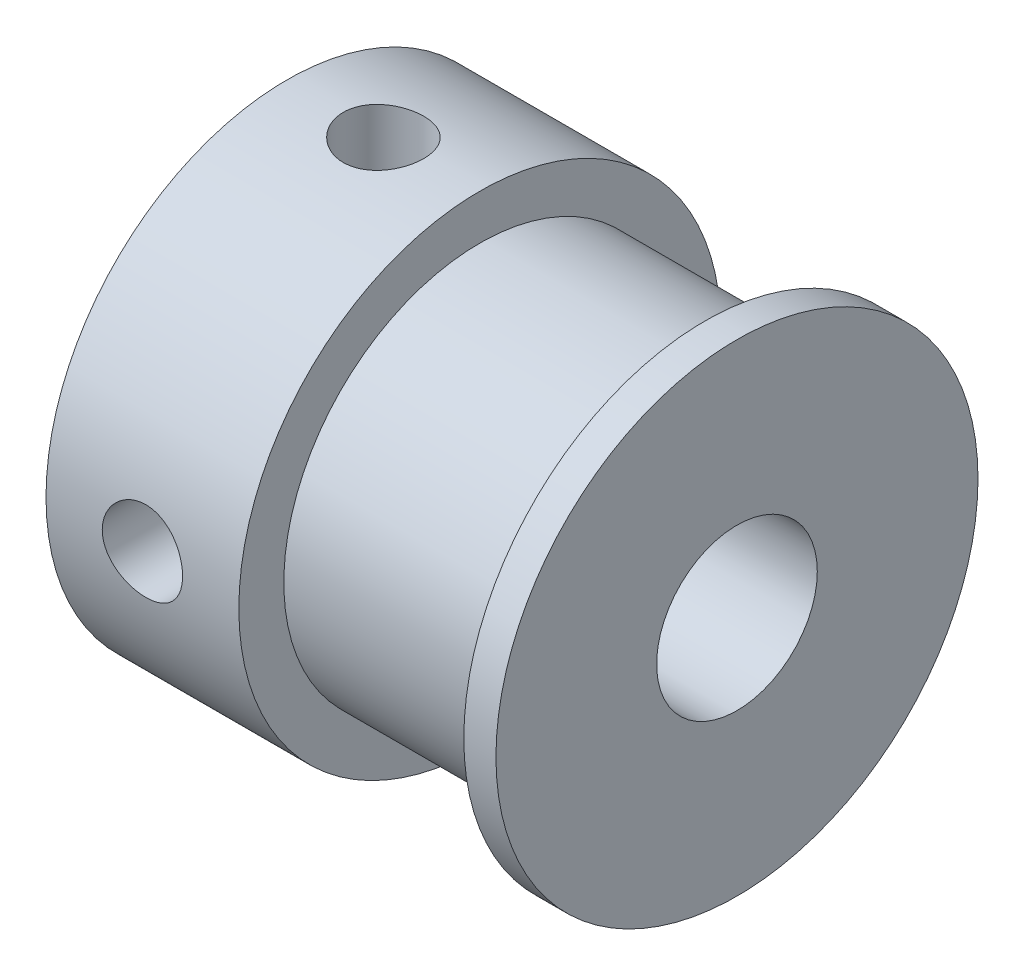
ISO-10303-21;
HEADER;
FILE_DESCRIPTION(('STEP AP214'),'2;1');
FILE_NAME('part.step','',(''),(''),'','','');
FILE_SCHEMA(('AUTOMOTIVE_DESIGN { 1 0 10303 214 1 1 1 1 }'));
ENDSEC;
DATA;
#1=APPLICATION_CONTEXT('core data for automotive mechanical design processes');
#2=APPLICATION_PROTOCOL_DEFINITION('international standard','automotive_design',2000,#1);
#3=PRODUCT_CONTEXT('',#1,'mechanical');
#4=PRODUCT('Part','Part','',(#3));
#5=PRODUCT_RELATED_PRODUCT_CATEGORY('part','',(#4));
#6=PRODUCT_DEFINITION_FORMATION('','',#4);
#7=PRODUCT_DEFINITION_CONTEXT('part definition',#1,'design');
#8=PRODUCT_DEFINITION('design','',#6,#7);
#9=PRODUCT_DEFINITION_SHAPE('','',#8);
#10=(LENGTH_UNIT() NAMED_UNIT(*) SI_UNIT(.MILLI.,.METRE.));
#11=(NAMED_UNIT(*) PLANE_ANGLE_UNIT() SI_UNIT($,.RADIAN.));
#12=(NAMED_UNIT(*) SI_UNIT($,.STERADIAN.) SOLID_ANGLE_UNIT());
#13=UNCERTAINTY_MEASURE_WITH_UNIT(LENGTH_MEASURE(1.E-05),#10,'distance_accuracy_value','');
#14=(GEOMETRIC_REPRESENTATION_CONTEXT(3) GLOBAL_UNCERTAINTY_ASSIGNED_CONTEXT((#13)) GLOBAL_UNIT_ASSIGNED_CONTEXT((#10,
#11,#12)) REPRESENTATION_CONTEXT('',''));
#15=CARTESIAN_POINT('',(0.,0.,0.));
#16=DIRECTION('',(0.,0.,1.));
#17=DIRECTION('',(1.,0.,0.));
#18=AXIS2_PLACEMENT_3D('',#15,#16,#17);
#19=CARTESIAN_POINT('',(0.,0.,0.));
#20=DIRECTION('',(1.,0.,0.));
#21=DIRECTION('',(0.,0.,-1.));
#22=AXIS2_PLACEMENT_3D('',#19,#20,#21);
#23=CYLINDRICAL_SURFACE('',#22,2.5);
#24=CARTESIAN_POINT('',(1.75000000000001,0.,2.5));
#25=CARTESIAN_POINT('',(1.75000412789938,0.0657149536912327,2.49999641755189));
#26=CARTESIAN_POINT('',(1.7552125914021,0.13150824962254,2.49738113774397));
#27=CARTESIAN_POINT('',(1.77581610042615,0.26115029408553,2.48717695046745));
#28=CARTESIAN_POINT('',(1.79123049124707,0.324995108391878,2.4795785978623));
#29=CARTESIAN_POINT('',(1.831492260771,0.448666931100716,2.4602034925414));
#30=CARTESIAN_POINT('',(1.85630298031002,0.508508503673972,2.448442989719));
#31=CARTESIAN_POINT('',(1.91446327670618,0.623090771008203,2.42182220644723));
#32=CARTESIAN_POINT('',(1.94781218031107,0.677831867487559,2.40696217041913));
#33=CARTESIAN_POINT('',(2.02439656185663,0.784384772202394,2.37445322822571));
#34=CARTESIAN_POINT('',(2.06810809904956,0.835819013902635,2.3566899890942));
#35=CARTESIAN_POINT('',(2.1631518490588,0.930974306083716,2.32074962808431));
#36=CARTESIAN_POINT('',(2.21448981471555,0.974689478883452,2.30257220261294));
#37=CARTESIAN_POINT('',(2.32810418690423,1.05656500056284,2.26623688996684));
#38=CARTESIAN_POINT('',(2.39092012293239,1.09403166943954,2.24818983712665));
#39=CARTESIAN_POINT('',(2.52295916998277,1.15771028361336,2.21607473465401));
#40=CARTESIAN_POINT('',(2.59217766090344,1.18393026870791,2.20200384508737));
#41=CARTESIAN_POINT('',(2.73083138177741,1.22266555273573,2.18072333797261));
#42=CARTESIAN_POINT('',(2.80000556508424,1.23590732135054,2.17315339479642));
#43=CARTESIAN_POINT('',(2.93997354722435,1.25053374163605,2.1647736243566));
#44=CARTESIAN_POINT('',(3.01076567608894,1.25193011046634,2.16395711679111));
#45=CARTESIAN_POINT('',(3.14285753039421,1.24335910896536,2.16888662821561));
#46=CARTESIAN_POINT('',(3.20428003902881,1.23473069942102,2.17385954577517));
#47=CARTESIAN_POINT('',(3.3246523867163,1.20867481132116,2.18845285917313));
#48=CARTESIAN_POINT('',(3.38360143163164,1.19124452987206,2.19807473539721));
#49=CARTESIAN_POINT('',(3.49903641570707,1.1477622254825,2.22109345515927));
#50=CARTESIAN_POINT('',(3.55543299848223,1.12151883389499,2.23457300829999));
#51=CARTESIAN_POINT('',(3.66329286573751,1.061302109585,2.26379255351755));
#52=CARTESIAN_POINT('',(3.71475391950011,1.02732530476558,2.27953355975239));
#53=CARTESIAN_POINT('',(3.81815156592903,0.94758256864098,2.31391447379108));
#54=CARTESIAN_POINT('',(3.86932109197019,0.900868072961596,2.33266887795933));
#55=CARTESIAN_POINT('',(3.96341927323862,0.799444473426712,2.36934529125509));
#56=CARTESIAN_POINT('',(4.00634399004235,0.744731570717852,2.38726689948501));
#57=CARTESIAN_POINT('',(4.08460707628715,0.625645632289807,2.42127484103705));
#58=CARTESIAN_POINT('',(4.11950059055717,0.560941989499257,2.43723730202509));
#59=CARTESIAN_POINT('',(4.17762128630375,0.425582769360993,2.46447351401553));
#60=CARTESIAN_POINT('',(4.20085773126895,0.354931970331593,2.47575098679441));
#61=CARTESIAN_POINT('',(4.23309425464584,0.215958114575875,2.49155417176795));
#62=CARTESIAN_POINT('',(4.24311404468347,0.147926913185404,2.4965617287664));
#63=CARTESIAN_POINT('',(4.2518309139181,0.0109744999366913,2.50091266823877));
#64=CARTESIAN_POINT('',(4.25053335704934,-0.057946274837377,2.5002587340164));
#65=CARTESIAN_POINT('',(4.23724163947655,-0.189041214982492,2.49363990316801));
#66=CARTESIAN_POINT('',(4.22608433408745,-0.251324260062442,2.48809057110237));
#67=CARTESIAN_POINT('',(4.19470241013114,-0.373008615377395,2.47277714143524));
#68=CARTESIAN_POINT('',(4.1744767919333,-0.432409607113745,2.46301257917916));
#69=CARTESIAN_POINT('',(4.12500191695853,-0.548610760562079,2.43980314267087));
#70=CARTESIAN_POINT('',(4.09551118735398,-0.605287996257689,2.42626102212424));
#71=CARTESIAN_POINT('',(4.02861558044244,-0.713076702123648,2.39679967896386));
#72=CARTESIAN_POINT('',(3.9912073317582,-0.764185787219099,2.38087944457232));
#73=CARTESIAN_POINT('',(3.9052994683339,-0.864709611613313,2.34635276671831));
#74=CARTESIAN_POINT('',(3.85607141443304,-0.913465097280795,2.32763606060552));
#75=CARTESIAN_POINT('',(3.75009356091336,-1.00232040139154,2.29077989504843));
#76=CARTESIAN_POINT('',(3.69333860147953,-1.04241423211355,2.27264084226908));
#77=CARTESIAN_POINT('',(3.57044543224961,-1.11463489312211,2.23813990282585));
#78=CARTESIAN_POINT('',(3.50398591723925,-1.14628186984829,2.2219066207934));
#79=CARTESIAN_POINT('',(3.36561241538434,-1.19760353251725,2.19467590460158));
#80=CARTESIAN_POINT('',(3.29370559187351,-1.21729364485946,2.18367172800773));
#81=CARTESIAN_POINT('',(3.15386222142319,-1.24232710931209,2.16951876260834));
#82=CARTESIAN_POINT('',(3.0862071832137,-1.24886624550107,2.16571729325614));
#83=CARTESIAN_POINT('',(2.95069116603659,-1.25086144297598,2.16456693307719));
#84=CARTESIAN_POINT('',(2.88283028907571,-1.24632230828049,2.16721524534441));
#85=CARTESIAN_POINT('',(2.75564562308498,-1.22740765699032,2.17797327562531));
#86=CARTESIAN_POINT('',(2.6961244123195,-1.21401039292849,2.18553868102992));
#87=CARTESIAN_POINT('',(2.58023985071912,-1.1789691977808,2.20463770234897));
#88=CARTESIAN_POINT('',(2.52387752238504,-1.15732261394975,2.21617259462095));
#89=CARTESIAN_POINT('',(2.41171893626674,-1.10476968162585,2.2428566295566));
#90=CARTESIAN_POINT('',(2.35621512271288,-1.07333892227057,2.25819652995239));
#91=CARTESIAN_POINT('',(2.25090682977427,-1.00268871454579,2.29044164543238));
#92=CARTESIAN_POINT('',(2.20110533685189,-0.963465214048303,2.30734767243153));
#93=CARTESIAN_POINT('',(2.10232252205298,-0.872754158330795,2.34327903949142));
#94=CARTESIAN_POINT('',(2.0541761220476,-0.820355528762707,2.36231229139336));
#95=CARTESIAN_POINT('',(1.96717127072046,-0.707693507775343,2.3984719031886));
#96=CARTESIAN_POINT('',(1.92831782571714,-0.647425904070975,2.4155972326005));
#97=CARTESIAN_POINT('',(1.86095454654725,-0.519914496024928,2.44622511981379));
#98=CARTESIAN_POINT('',(1.83251978823571,-0.452624379918263,2.45970120703636));
#99=CARTESIAN_POINT('',(1.78773979010132,-0.313427626617735,2.48126676704332));
#100=CARTESIAN_POINT('',(1.77136019146303,-0.241534749528953,2.48937154216165));
#101=CARTESIAN_POINT('',(1.7576282361552,-0.140752433104227,2.49619327387079));
#102=CARTESIAN_POINT('',(1.75477169892048,-0.112702349299371,2.49761706674002));
#103=CARTESIAN_POINT('',(1.750956668104,-0.0564396647589458,2.49952121222331));
#104=CARTESIAN_POINT('',(1.74999822691101,-0.0282270595592261,2.50000153879704));
#105=CARTESIAN_POINT('',(1.75000000000001,0.,2.5));
#106=B_SPLINE_CURVE_WITH_KNOTS('',3,(#24,#25,#26,#27,#28,#29,#30,#31,#32,#33,#34,#35,#36,#37,
#38,#39,#40,#41,#42,#43,#44,#45,#46,#47,#48,#49,#50,#51,#52,#53,#54,#55,#56,#57,#58,#59,#60,#61,
#62,#63,#64,#65,#66,#67,#68,#69,#70,#71,#72,#73,#74,#75,#76,#77,#78,#79,#80,#81,#82,#83,#84,#85,
#86,#87,#88,#89,#90,#91,#92,#93,#94,#95,#96,#97,#98,#99,#100,#101,#102,#103,#104,#105),
.UNSPECIFIED.,.T.,.F.,(4,2,2,2,2,2,2,2,2,2,2,2,2,2,2,2,2,2,2,2,2,2,2,2,2,2,2,2,2,2,2,2,2,2,2,2,
2,2,2,2,4),(0.,0.197030321775364,0.394435187136495,0.59107769436537,0.787704700726955,
0.996227198397605,1.20490779706754,1.4297715803844,1.6544743487285,1.86572515175286,
2.07676696661274,2.26257140511649,2.44843504907097,2.63862800210608,2.82890651575276,
3.04331176667346,3.25781918248356,3.48228777768049,3.70657771140347,3.9122911308918,
4.11790705639343,4.3075863313265,4.49728652038662,4.69241070034871,4.88761813435421,
5.10199513305521,5.31651985769287,5.54143352699589,5.76605639925969,5.96911634372963,
6.17208824825003,6.35572412805225,6.53941910979594,6.73545570969514,6.93159451423693,
7.15156553440619,7.37165479220712,7.59330017078652,7.81431135781158,7.89894100172117,
7.98357298143554),.UNSPECIFIED.);
#107=CARTESIAN_POINT('',(1.75000000000001,0.,2.5));
#108=VERTEX_POINT('',#107);
#109=EDGE_CURVE('E91',#108,#108,#106,.T.);
#110=ORIENTED_EDGE('',*,*,#109,.F.);
#111=EDGE_LOOP('',(#110));
#112=FACE_BOUND('',#111,.T.);
#113=CARTESIAN_POINT('',(3.,2.1650635094611,-1.25));
#114=CARTESIAN_POINT('',(3.06513476024406,2.16506918410574,-1.24999545384316));
#115=CARTESIAN_POINT('',(3.13035176440631,2.16804751484696,-1.24487496341652));
#116=CARTESIAN_POINT('',(3.25878408084644,2.17952958065066,-1.22465401237257));
#117=CARTESIAN_POINT('',(3.32199489380426,2.18804492569449,-1.20953258069272));
#118=CARTESIAN_POINT('',(3.44431458042993,2.20936683256748,-1.17012493587476));
#119=CARTESIAN_POINT('',(3.50344331559198,2.22215054341565,-1.14588744061716));
#120=CARTESIAN_POINT('',(3.6167802524959,2.25053331021072,-1.08908440672046));
#121=CARTESIAN_POINT('',(3.67098818782807,2.26613251845081,-1.05651841754472));
#122=CARTESIAN_POINT('',(3.77788216069688,2.29996086321802,-0.980833175663598));
#123=CARTESIAN_POINT('',(3.83007391959193,2.31830079547442,-0.937065045179713));
#124=CARTESIAN_POINT('',(3.92676048550839,2.35464978482132,-0.841567259518085));
#125=CARTESIAN_POINT('',(3.9712514532294,2.37265867289062,-0.789833657227866));
#126=CARTESIAN_POINT('',(4.05420893893458,2.40776846191186,-0.675611954268182));
#127=CARTESIAN_POINT('',(4.09206720982441,2.42472633022716,-0.612633986265718));
#128=CARTESIAN_POINT('',(4.1564260665572,2.45438445124411,-0.48019628324938));
#129=CARTESIAN_POINT('',(4.18293382017146,2.46708738979677,-0.410740672672694));
#130=CARTESIAN_POINT('',(4.22188082662637,2.48600576555297,-0.272556179907471));
#131=CARTESIAN_POINT('',(4.23518690794442,2.49261850276115,-0.204127238111022));
#132=CARTESIAN_POINT('',(4.2502076483438,2.50009479807584,-0.0657132858723104));
#133=CARTESIAN_POINT('',(4.25192932099464,2.50096183480737,0.00427075730467264));
#134=CARTESIAN_POINT('',(4.24406665753706,2.49703727395563,0.137290655529687));
#135=CARTESIAN_POINT('',(4.23545248059847,2.49273119865201,0.200401498970989));
#136=CARTESIAN_POINT('',(4.20889894511918,2.47967806574684,0.324142214897902));
#137=CARTESIAN_POINT('',(4.19095888877972,2.47093067582992,0.384771901367406));
#138=CARTESIAN_POINT('',(4.14614679238773,2.44964479109568,0.502886739461942));
#139=CARTESIAN_POINT('',(4.11915460853491,2.43705551911499,0.560316779393972));
#140=CARTESIAN_POINT('',(4.05717072974813,2.40922057483359,0.66997100189166));
#141=CARTESIAN_POINT('',(4.02217617087206,2.39397395196855,0.722193311048307));
#142=CARTESIAN_POINT('',(3.94138081058373,2.36055492999037,0.825217076122743));
#143=CARTESIAN_POINT('',(3.89487121459249,2.34224219997719,0.8754175937867));
#144=CARTESIAN_POINT('',(3.79426284383728,2.30567925733515,0.967630462872225));
#145=CARTESIAN_POINT('',(3.74015828465742,2.28742910332036,1.00963651446779));
#146=CARTESIAN_POINT('',(3.62168975946989,2.25180195115606,1.08688166830276));
#147=CARTESIAN_POINT('',(3.55689247118223,2.23455399988385,1.12152164372256));
#148=CARTESIAN_POINT('',(3.42132791080125,2.2046931284822,1.17914889125154));
#149=CARTESIAN_POINT('',(3.35056695872805,2.19207537557584,1.20214832276361));
#150=CARTESIAN_POINT('',(3.21098186089651,2.17430794771293,1.2339752637813));
#151=CARTESIAN_POINT('',(3.14244860119556,2.16864569810621,1.24378140264997));
#152=CARTESIAN_POINT('',(3.00449832310432,2.16397399202012,1.25189618326428));
#153=CARTESIAN_POINT('',(2.93508196360027,2.1649598361164,1.25021294664378));
#154=CARTESIAN_POINT('',(2.80543260177659,2.17292920675731,1.23629505417996));
#155=CARTESIAN_POINT('',(2.74502568611509,2.17924484383318,1.22523477089058));
#156=CARTESIAN_POINT('',(2.6270402671613,2.19617526939176,1.19462035579055));
#157=CARTESIAN_POINT('',(2.56946268656674,2.20679145006292,1.17506347327952));
#158=CARTESIAN_POINT('',(2.45573583637163,2.23170277599571,1.12705948575611));
#159=CARTESIAN_POINT('',(2.39977622893306,2.24614554053829,1.0982425796159));
#160=CARTESIAN_POINT('',(2.29316341057626,2.27695149371562,1.03285883001975));
#161=CARTESIAN_POINT('',(2.2425129456084,2.29331566693935,0.99628800541527));
#162=CARTESIAN_POINT('',(2.14127654059557,2.3285999807042,0.911046458998566));
#163=CARTESIAN_POINT('',(2.09150356160293,2.34758228942861,0.861431590393708));
#164=CARTESIAN_POINT('',(2.00073470250801,2.38417793722366,0.75425561924786));
#165=CARTESIAN_POINT('',(1.95974178721183,2.40179081259637,0.696691843319183));
#166=CARTESIAN_POINT('',(1.88678284256237,2.43426702113696,0.573169203198446));
#167=CARTESIAN_POINT('',(1.85508360223636,2.44904552090037,0.507028871967641));
#168=CARTESIAN_POINT('',(1.80357762017826,2.47354193699126,0.369402955801352));
#169=CARTESIAN_POINT('',(1.78376043579212,2.48326429595466,0.29792212674022));
#170=CARTESIAN_POINT('',(1.75828929478167,2.49584385227353,0.158724602913021));
#171=CARTESIAN_POINT('',(1.75150265515486,2.49924909885239,0.0912643048130715));
#172=CARTESIAN_POINT('',(1.748945918182,2.50052662968914,-0.0439074824390041));
#173=CARTESIAN_POINT('',(1.75317196434555,2.49840085083612,-0.111618875368858));
#174=CARTESIAN_POINT('',(1.77177050849453,2.48917461047403,-0.240672490396433));
#175=CARTESIAN_POINT('',(1.78545606157209,2.48241118334987,-0.302140397264079));
#176=CARTESIAN_POINT('',(1.82165874912871,2.46490117079279,-0.421807440229521));
#177=CARTESIAN_POINT('',(1.84417715011682,2.45415401415995,-0.480006106194385));
#178=CARTESIAN_POINT('',(1.89840881520747,2.4290741343515,-0.594279257806105));
#179=CARTESIAN_POINT('',(1.9304741540098,2.41460771498499,-0.650156428375057));
#180=CARTESIAN_POINT('',(2.00244741357381,2.38360166427283,-0.75596830226753));
#181=CARTESIAN_POINT('',(2.04235893639459,2.36706108197951,-0.805900259268633));
#182=CARTESIAN_POINT('',(2.13349642377838,2.33160762783285,-0.903642505196113));
#183=CARTESIAN_POINT('',(2.18545310934649,2.31262248764622,-0.950747105674089));
#184=CARTESIAN_POINT('',(2.29681340141221,2.27578845203566,-1.03582910924334));
#185=CARTESIAN_POINT('',(2.35622352608461,2.25794057202332,-1.07379843751257));
#186=CARTESIAN_POINT('',(2.48329580822619,2.22499506631145,-1.14053884973207));
#187=CARTESIAN_POINT('',(2.55115941391092,2.21000217820338,-1.16898133245117));
#188=CARTESIAN_POINT('',(2.69166550542472,2.1858269541044,-1.21359838688301));
#189=CARTESIAN_POINT('',(2.76429111114086,2.17662520184628,-1.22981398896918));
#190=CARTESIAN_POINT('',(2.864756694565,2.16911590752238,-1.24295875983052));
#191=CARTESIAN_POINT('',(2.89170986799735,2.1676016125644,-1.24559513120481));
#192=CARTESIAN_POINT('',(2.9457706008528,2.16557419859688,-1.24911675636245));
#193=CARTESIAN_POINT('',(2.97287817048234,2.16506114656387,-1.25000189299984));
#194=CARTESIAN_POINT('',(3.,2.1650635094611,-1.25));
#195=B_SPLINE_CURVE_WITH_KNOTS('',3,(#113,#114,#115,#116,#117,#118,#119,#120,#121,#122,#123,
#124,#125,#126,#127,#128,#129,#130,#131,#132,#133,#134,#135,#136,#137,#138,#139,#140,#141,#142,
#143,#144,#145,#146,#147,#148,#149,#150,#151,#152,#153,#154,#155,#156,#157,#158,#159,#160,#161,
#162,#163,#164,#165,#166,#167,#168,#169,#170,#171,#172,#173,#174,#175,#176,#177,#178,#179,#180,
#181,#182,#183,#184,#185,#186,#187,#188,#189,#190,#191,#192,#193,#194),.UNSPECIFIED.,.T.,.F.,(4,
2,2,2,2,2,2,2,2,2,2,2,2,2,2,2,2,2,2,2,2,2,2,2,2,2,2,2,2,2,2,2,2,2,2,2,2,2,2,2,4),(0.,
0.195290153243394,0.390991116031005,0.585660744898606,0.780340906806436,0.99107789062279,
1.20191963855464,1.42697365298454,1.65188533704864,1.86079356209919,2.0695752960755,
2.26020121855673,2.45084140646819,2.64411918413933,2.8374662418784,3.04908989321113,
3.26087560307398,3.4861105216181,3.71110967764631,3.91827863567764,4.12530116485466,
4.30967729280032,4.49411315545078,4.68709120507609,4.88016857775059,5.09758429475766,
5.31507331222752,5.53830226766207,5.76133474760964,5.96390337986858,6.16640108492464,
6.35555531089365,6.54473666890016,6.74200938399339,6.93937287625898,7.15637802312584,
7.37357428556442,7.59763436298256,7.8209391625345,7.90225168981636,7.98356965618175),.UNSPECIFIED.);
#196=CARTESIAN_POINT('',(3.,2.1650635094611,-1.25));
#197=VERTEX_POINT('',#196);
#198=EDGE_CURVE('E84',#197,#197,#195,.T.);
#199=ORIENTED_EDGE('',*,*,#198,.F.);
#200=EDGE_LOOP('',(#199));
#201=FACE_BOUND('',#200,.T.);
#202=CARTESIAN_POINT('',(14.,0.,0.));
#203=DIRECTION('',(1.,0.,0.));
#204=DIRECTION('',(0.,0.,-1.));
#205=AXIS2_PLACEMENT_3D('',#202,#203,#204);
#206=CIRCLE('',#205,2.5);
#207=CARTESIAN_POINT('',(14.,0.,-2.5));
#208=VERTEX_POINT('',#207);
#209=EDGE_CURVE('E90',#208,#208,#206,.T.);
#210=ORIENTED_EDGE('',*,*,#209,.T.);
#211=EDGE_LOOP('',(#210));
#212=FACE_BOUND('',#211,.T.);
#213=CARTESIAN_POINT('',(0.,0.,0.));
#214=DIRECTION('',(1.,0.,0.));
#215=DIRECTION('',(0.,0.,-1.));
#216=AXIS2_PLACEMENT_3D('',#213,#214,#215);
#217=CIRCLE('',#216,2.5);
#218=CARTESIAN_POINT('',(0.,0.,-2.5));
#219=VERTEX_POINT('',#218);
#220=EDGE_CURVE('E60',#219,#219,#217,.T.);
#221=ORIENTED_EDGE('',*,*,#220,.F.);
#222=EDGE_LOOP('',(#221));
#223=FACE_BOUND('',#222,.T.);
#224=ADVANCED_FACE('F45',(#112,#201,#212,#223),#23,.F.);
#225=CARTESIAN_POINT('',(0.,2.5,0.));
#226=DIRECTION('',(-1.,0.,0.));
#227=DIRECTION('',(0.,0.,1.));
#228=AXIS2_PLACEMENT_3D('',#225,#226,#227);
#229=PLANE('',#228);
#230=ORIENTED_EDGE('',*,*,#220,.T.);
#231=EDGE_LOOP('',(#230));
#232=FACE_BOUND('',#231,.T.);
#233=CARTESIAN_POINT('',(0.,0.,0.));
#234=DIRECTION('',(1.,0.,0.));
#235=DIRECTION('',(0.,0.,-1.));
#236=AXIS2_PLACEMENT_3D('',#233,#234,#235);
#237=CIRCLE('',#236,7.5);
#238=CARTESIAN_POINT('',(0.,0.,-7.5));
#239=VERTEX_POINT('',#238);
#240=EDGE_CURVE('E64',#239,#239,#237,.T.);
#241=ORIENTED_EDGE('',*,*,#240,.F.);
#242=EDGE_LOOP('',(#241));
#243=FACE_BOUND('',#242,.T.);
#244=ADVANCED_FACE('F115',(#232,#243),#229,.T.);
#245=CARTESIAN_POINT('',(0.,0.,0.));
#246=DIRECTION('',(1.,0.,0.));
#247=DIRECTION('',(0.,0.,-1.));
#248=AXIS2_PLACEMENT_3D('',#245,#246,#247);
#249=CYLINDRICAL_SURFACE('',#248,7.5);
#250=CARTESIAN_POINT('',(1.75000000000001,0.,7.5));
#251=CARTESIAN_POINT('',(1.75000279447392,-0.069695452479107,7.49999880584412));
#252=CARTESIAN_POINT('',(1.75584863748447,-0.13942894091941,7.49901838956517));
#253=CARTESIAN_POINT('',(1.77906782938267,-0.27694011083652,7.49520172470694));
#254=CARTESIAN_POINT('',(1.79645177845581,-0.344715933979622,7.49236376961945));
#255=CARTESIAN_POINT('',(1.84220772429638,-0.476302373606319,7.48515034118225));
#256=CARTESIAN_POINT('',(1.87057073282029,-0.540116184215947,7.48077612579597));
#257=CARTESIAN_POINT('',(1.9374561460262,-0.662070920988969,7.47097113541035));
#258=CARTESIAN_POINT('',(1.9759773887415,-0.720212494939292,7.46554048127217));
#259=CARTESIAN_POINT('',(2.06247754191024,-0.829736307145835,7.45416658729157));
#260=CARTESIAN_POINT('',(2.11053455731807,-0.881056451767479,7.44821935907428));
#261=CARTESIAN_POINT('',(2.21457398423641,-0.974944249329958,7.43651313438366));
#262=CARTESIAN_POINT('',(2.27055689572831,-1.01751134969548,7.43075414981334));
#263=CARTESIAN_POINT('',(2.38928548309853,-1.09293356280256,7.4200378287989));
#264=CARTESIAN_POINT('',(2.45207066840238,-1.12572727643049,7.41508564545818));
#265=CARTESIAN_POINT('',(2.58235478215032,-1.1802791827056,7.40659894897337));
#266=CARTESIAN_POINT('',(2.64985339183882,-1.2020381207828,7.40306434007154));
#267=CARTESIAN_POINT('',(2.78699013742827,-1.2337071888924,7.39785268421378));
#268=CARTESIAN_POINT('',(2.8566028682507,-1.24372451456769,7.3961588424285));
#269=CARTESIAN_POINT('',(2.99654013844174,-1.25195836264493,7.39476969468325));
#270=CARTESIAN_POINT('',(3.06686462708365,-1.25017572019449,7.39507424728607));
#271=CARTESIAN_POINT('',(3.20546393063772,-1.23494754919807,7.39763214431778));
#272=CARTESIAN_POINT('',(3.27375240177262,-1.22162244094488,7.39986536659458));
#273=CARTESIAN_POINT('',(3.40711065891456,-1.18387657020172,7.40599747605504));
#274=CARTESIAN_POINT('',(3.47218033444427,-1.15945542715986,7.40989642036636));
#275=CARTESIAN_POINT('',(3.59761441172046,-1.10008862304695,7.4189423966705));
#276=CARTESIAN_POINT('',(3.65795470304061,-1.06509295693985,7.42409533553663));
#277=CARTESIAN_POINT('',(3.77195220026919,-0.985606008778711,7.43506459207505));
#278=CARTESIAN_POINT('',(3.82560886622746,-0.941113960327138,7.44088096327143));
#279=CARTESIAN_POINT('',(3.92541304290367,-0.843241106079522,7.45261013939893));
#280=CARTESIAN_POINT('',(3.97145925927004,-0.789756981936559,7.45852324615826));
#281=CARTESIAN_POINT('',(4.05393888133267,-0.675767624490819,7.46971300698362));
#282=CARTESIAN_POINT('',(4.09037222509161,-0.615262345953207,7.47498965694873));
#283=CARTESIAN_POINT('',(4.15260111356814,-0.488852958083352,7.48431946446456));
#284=CARTESIAN_POINT('',(4.17838770966562,-0.422944362782327,7.48837159203724));
#285=CARTESIAN_POINT('',(4.21849710762298,-0.287649172801363,7.4947875150633));
#286=CARTESIAN_POINT('',(4.23282086848685,-0.218262869589732,7.49715145175237));
#287=CARTESIAN_POINT('',(4.24946067923056,-0.0788549506508106,7.49990564921343));
#288=CARTESIAN_POINT('',(4.2519157859028,-0.0088503685755048,7.50031876506392));
#289=CARTESIAN_POINT('',(4.24511932778593,0.130569886444944,7.49918737210585));
#290=CARTESIAN_POINT('',(4.23586821343312,0.199985581946019,7.49764293862059));
#291=CARTESIAN_POINT('',(4.20603757533225,0.33582808777338,7.49278413469101));
#292=CARTESIAN_POINT('',(4.18552689580493,0.402270434192688,7.48948052400655));
#293=CARTESIAN_POINT('',(4.13383274090023,0.530773442430219,7.48147232227679));
#294=CARTESIAN_POINT('',(4.10264866618236,0.592833857954856,7.4767676525601));
#295=CARTESIAN_POINT('',(4.0301744376516,0.711415344734475,7.46642258151204));
#296=CARTESIAN_POINT('',(3.98879742191637,0.76788262546857,7.46077427943511));
#297=CARTESIAN_POINT('',(3.89723134230746,0.873121792751339,7.4491923369595));
#298=CARTESIAN_POINT('',(3.84704163836166,0.921893119848286,7.44325867585773));
#299=CARTESIAN_POINT('',(3.73865122596428,1.01087138982899,7.43170087617923));
#300=CARTESIAN_POINT('',(3.68037291724279,1.05098438055685,7.42608058068553));
#301=CARTESIAN_POINT('',(3.55782351543073,1.12085115514749,7.41585764888942));
#302=CARTESIAN_POINT('',(3.49355261238625,1.1506052673849,7.4112549803301));
#303=CARTESIAN_POINT('',(3.36110513359393,1.19876916573657,7.40361726848852));
#304=CARTESIAN_POINT('',(3.29294595248475,1.21722571627397,7.40057577155532));
#305=CARTESIAN_POINT('',(3.15443993538912,1.24241772688913,7.3963885841763));
#306=CARTESIAN_POINT('',(3.08409329013397,1.24915420597308,7.39524272891361));
#307=CARTESIAN_POINT('',(2.9441474170188,1.25068643302367,7.39498366542006));
#308=CARTESIAN_POINT('',(2.87454981071236,1.24563006806259,7.39584528252825));
#309=CARTESIAN_POINT('',(2.73721037597462,1.22403991947842,7.39944890726864));
#310=CARTESIAN_POINT('',(2.66946854152907,1.20750617305623,7.40219090880607));
#311=CARTESIAN_POINT('',(2.5378207813537,1.16348724479744,7.40923678140859));
#312=CARTESIAN_POINT('',(2.47391049497199,1.13601479530021,7.41353883609835));
#313=CARTESIAN_POINT('',(2.35158216540258,1.07091350195795,7.42322184461104));
#314=CARTESIAN_POINT('',(2.29316439481394,1.03328415437427,7.428602851942));
#315=CARTESIAN_POINT('',(2.18273220844613,0.948409442186072,7.43991727022811));
#316=CARTESIAN_POINT('',(2.13080199164987,0.901055281796818,7.44585647788151));
#317=CARTESIAN_POINT('',(2.03557419776254,0.79830451569011,7.45757186180421));
#318=CARTESIAN_POINT('',(1.99227861568092,0.742906056456313,7.46334800013273));
#319=CARTESIAN_POINT('',(1.91527586590003,0.625184584820136,7.4741326482111));
#320=CARTESIAN_POINT('',(1.88163698034353,0.562816393766405,7.47913558126552));
#321=CARTESIAN_POINT('',(1.82536525769505,0.433256534689487,7.48775583800888));
#322=CARTESIAN_POINT('',(1.80272145946016,0.366069747415002,7.49137454088741));
#323=CARTESIAN_POINT('',(1.77399736293667,0.248851655022698,7.49602895416478));
#324=CARTESIAN_POINT('',(1.76501276519202,0.199529415149222,7.49751013636679));
#325=CARTESIAN_POINT('',(1.75301313107763,0.100144655159903,7.4994960799306));
#326=CARTESIAN_POINT('',(1.74999799193133,0.0500821478042465,7.50000085810321));
#327=CARTESIAN_POINT('',(1.75000000000001,0.,7.5));
#328=B_SPLINE_CURVE_WITH_KNOTS('',3,(#250,#251,#252,#253,#254,#255,#256,#257,#258,#259,#260,
#261,#262,#263,#264,#265,#266,#267,#268,#269,#270,#271,#272,#273,#274,#275,#276,#277,#278,#279,
#280,#281,#282,#283,#284,#285,#286,#287,#288,#289,#290,#291,#292,#293,#294,#295,#296,#297,#298,
#299,#300,#301,#302,#303,#304,#305,#306,#307,#308,#309,#310,#311,#312,#313,#314,#315,#316,#317,
#318,#319,#320,#321,#322,#323,#324,#325,#326,#327),.UNSPECIFIED.,.T.,.F.,(4,2,2,2,2,2,2,2,2,2,2,
2,2,2,2,2,2,2,2,2,2,2,2,2,2,2,2,2,2,2,2,2,2,2,2,2,2,2,4),(0.,0.208903292469254,
0.417998772847708,0.626923433512632,0.835824206337391,1.04651245531165,1.25721400084928,
1.46921260411919,1.6811968843809,1.89123038551711,2.10124902160442,2.30910260880203,
2.51696332512689,2.72582278316277,2.93469910340285,3.14616384955662,3.35762995817922,
3.5692734445795,3.78089922260572,3.99003941745696,4.19917156517927,4.40703903503205,
4.61491817913031,4.82463412813509,5.03436531527139,5.24626911003807,5.45816618687968,
5.66918011170883,5.88017568893306,6.08853954761347,6.29690273094063,6.50502409113108,
6.71315577514664,6.92375692096692,7.13440666939482,7.34651115803596,7.55840376065032,
7.70852124082005,7.85863613638479),.UNSPECIFIED.);
#329=CARTESIAN_POINT('',(1.75000000000001,0.,7.5));
#330=VERTEX_POINT('',#329);
#331=EDGE_CURVE('E12',#330,#330,#328,.T.);
#332=ORIENTED_EDGE('',*,*,#331,.F.);
#333=EDGE_LOOP('',(#332));
#334=FACE_BOUND('',#333,.T.);
#335=CARTESIAN_POINT('',(4.25,7.5,0.));
#336=CARTESIAN_POINT('',(4.24999720552609,7.49999880584412,-0.0696954524791073));
#337=CARTESIAN_POINT('',(4.24415136251554,7.49901838956517,-0.13942894091941));
#338=CARTESIAN_POINT('',(4.22093217061734,7.49520172470694,-0.276940110836521));
#339=CARTESIAN_POINT('',(4.2035482215442,7.49236376961945,-0.344715933979623));
#340=CARTESIAN_POINT('',(4.15779227570362,7.48515034118225,-0.476302373606321));
#341=CARTESIAN_POINT('',(4.12942926717971,7.48077612579596,-0.54011618421595));
#342=CARTESIAN_POINT('',(4.0625438539738,7.47097113541035,-0.662070920988972));
#343=CARTESIAN_POINT('',(4.0240226112585,7.46554048127217,-0.720212494939295));
#344=CARTESIAN_POINT('',(3.93752245808977,7.45416658729156,-0.829736307145839));
#345=CARTESIAN_POINT('',(3.88946544268193,7.44821935907428,-0.881056451767483));
#346=CARTESIAN_POINT('',(3.78542601576359,7.43651313438366,-0.974944249329963));
#347=CARTESIAN_POINT('',(3.72944310427169,7.43075414981334,-1.01751134969548));
#348=CARTESIAN_POINT('',(3.61071451690147,7.4200378287989,-1.09293356280257));
#349=CARTESIAN_POINT('',(3.54792933159762,7.41508564545818,-1.1257272764305));
#350=CARTESIAN_POINT('',(3.41764521784969,7.40659894897337,-1.18027918270561));
#351=CARTESIAN_POINT('',(3.35014660816118,7.40306434007154,-1.20203812078281));
#352=CARTESIAN_POINT('',(3.21300986257173,7.39785268421378,-1.2337071888924));
#353=CARTESIAN_POINT('',(3.1433971317493,7.3961588424285,-1.2437245145677));
#354=CARTESIAN_POINT('',(3.00345986155826,7.39476969468325,-1.25195836264494));
#355=CARTESIAN_POINT('',(2.93313537291635,7.39507424728607,-1.2501757201945));
#356=CARTESIAN_POINT('',(2.79453606936228,7.39763214431777,-1.23494754919808));
#357=CARTESIAN_POINT('',(2.72624759822738,7.39986536659458,-1.22162244094489));
#358=CARTESIAN_POINT('',(2.59288934108543,7.40599747605504,-1.18387657020172));
#359=CARTESIAN_POINT('',(2.52781966555573,7.40989642036636,-1.15945542715987));
#360=CARTESIAN_POINT('',(2.40238558827954,7.4189423966705,-1.10008862304696));
#361=CARTESIAN_POINT('',(2.34204529695939,7.42409533553663,-1.06509295693986));
#362=CARTESIAN_POINT('',(2.22804779973081,7.43506459207504,-0.985606008778716));
#363=CARTESIAN_POINT('',(2.17439113377253,7.44088096327143,-0.941113960327143));
#364=CARTESIAN_POINT('',(2.07458695709633,7.45261013939893,-0.843241106079526));
#365=CARTESIAN_POINT('',(2.02854074072996,7.45852324615826,-0.789756981936563));
#366=CARTESIAN_POINT('',(1.94606111866733,7.46971300698362,-0.675767624490822));
#367=CARTESIAN_POINT('',(1.90962777490839,7.47498965694873,-0.61526234595321));
#368=CARTESIAN_POINT('',(1.84739888643186,7.48431946446456,-0.488852958083355));
#369=CARTESIAN_POINT('',(1.82161229033437,7.48837159203724,-0.42294436278233));
#370=CARTESIAN_POINT('',(1.78150289237701,7.4947875150633,-0.287649172801365));
#371=CARTESIAN_POINT('',(1.76717913151314,7.49715145175237,-0.218262869589734));
#372=CARTESIAN_POINT('',(1.75053932076943,7.49990564921343,-0.0788549506508116));
#373=CARTESIAN_POINT('',(1.7480842140972,7.50031876506392,-0.00885036857550548));
#374=CARTESIAN_POINT('',(1.75488067221406,7.49918737210585,0.130569886444944));
#375=CARTESIAN_POINT('',(1.76413178656687,7.49764293862059,0.199985581946019));
#376=CARTESIAN_POINT('',(1.79396242466774,7.49278413469101,0.335828087773382));
#377=CARTESIAN_POINT('',(1.81447310419506,7.48948052400655,0.402270434192689));
#378=CARTESIAN_POINT('',(1.86616725909977,7.48147232227679,0.530773442430221));
#379=CARTESIAN_POINT('',(1.89735133381764,7.4767676525601,0.592833857954859));
#380=CARTESIAN_POINT('',(1.96982556234839,7.46642258151204,0.711415344734479));
#381=CARTESIAN_POINT('',(2.01120257808363,7.46077427943511,0.767882625468573));
#382=CARTESIAN_POINT('',(2.10276865769253,7.4491923369595,0.873121792751343));
#383=CARTESIAN_POINT('',(2.15295836163834,7.44325867585773,0.921893119848291));
#384=CARTESIAN_POINT('',(2.26134877403571,7.43170087617923,1.010871389829));
#385=CARTESIAN_POINT('',(2.31962708275721,7.42608058068553,1.05098438055686));
#386=CARTESIAN_POINT('',(2.44217648456927,7.41585764888942,1.12085115514749));
#387=CARTESIAN_POINT('',(2.50644738761375,7.4112549803301,1.15060526738491));
#388=CARTESIAN_POINT('',(2.63889486640607,7.40361726848852,1.19876916573657));
#389=CARTESIAN_POINT('',(2.70705404751524,7.40057577155532,1.21722571627397));
#390=CARTESIAN_POINT('',(2.84556006461088,7.3963885841763,1.24241772688914));
#391=CARTESIAN_POINT('',(2.91590670986603,7.39524272891361,1.24915420597308));
#392=CARTESIAN_POINT('',(3.0558525829812,7.39498366542006,1.25068643302368));
#393=CARTESIAN_POINT('',(3.12545018928764,7.39584528252825,1.24563006806259));
#394=CARTESIAN_POINT('',(3.26278962402538,7.39944890726864,1.22403991947842));
#395=CARTESIAN_POINT('',(3.33053145847094,7.40219090880607,1.20750617305624));
#396=CARTESIAN_POINT('',(3.46217921864631,7.40923678140859,1.16348724479745));
#397=CARTESIAN_POINT('',(3.52608950502801,7.41353883609835,1.13601479530022));
#398=CARTESIAN_POINT('',(3.64841783459742,7.42322184461104,1.07091350195795));
#399=CARTESIAN_POINT('',(3.70683560518607,7.428602851942,1.03328415437428));
#400=CARTESIAN_POINT('',(3.81726779155388,7.43991727022811,0.948409442186077));
#401=CARTESIAN_POINT('',(3.86919800835014,7.44585647788151,0.901055281796823));
#402=CARTESIAN_POINT('',(3.96442580223747,7.4575718618042,0.798304515690114));
#403=CARTESIAN_POINT('',(4.00772138431909,7.46334800013273,0.742906056456317));
#404=CARTESIAN_POINT('',(4.08472413409997,7.4741326482111,0.62518458482014));
#405=CARTESIAN_POINT('',(4.11836301965648,7.47913558126552,0.562816393766409));
#406=CARTESIAN_POINT('',(4.17463474230496,7.48775583800888,0.43325653468949));
#407=CARTESIAN_POINT('',(4.19727854053985,7.49137454088741,0.366069747415004));
#408=CARTESIAN_POINT('',(4.22600263706333,7.49602895416478,0.2488516550227));
#409=CARTESIAN_POINT('',(4.23498723480798,7.49751013636679,0.199529415149223));
#410=CARTESIAN_POINT('',(4.24698686892238,7.4994960799306,0.100144655159904));
#411=CARTESIAN_POINT('',(4.25000200806868,7.50000085810321,0.050082147804247));
#412=CARTESIAN_POINT('',(4.25,7.5,0.));
#413=B_SPLINE_CURVE_WITH_KNOTS('',3,(#335,#336,#337,#338,#339,#340,#341,#342,#343,#344,#345,
#346,#347,#348,#349,#350,#351,#352,#353,#354,#355,#356,#357,#358,#359,#360,#361,#362,#363,#364,
#365,#366,#367,#368,#369,#370,#371,#372,#373,#374,#375,#376,#377,#378,#379,#380,#381,#382,#383,
#384,#385,#386,#387,#388,#389,#390,#391,#392,#393,#394,#395,#396,#397,#398,#399,#400,#401,#402,
#403,#404,#405,#406,#407,#408,#409,#410,#411,#412),.UNSPECIFIED.,.T.,.F.,(4,2,2,2,2,2,2,2,2,2,2,
2,2,2,2,2,2,2,2,2,2,2,2,2,2,2,2,2,2,2,2,2,2,2,2,2,2,2,4),(0.,0.208903292469254,0.41799877284771,
0.626923433512634,0.835824206337395,1.04651245531166,1.25721400084928,1.4692126041192,
1.6811968843809,1.89123038551712,2.10124902160443,2.30910260880204,2.5169633251269,
2.72582278316278,2.93469910340286,3.14616384955663,3.35762995817923,3.56927344457951,
3.78089922260574,3.99003941745698,4.19917156517929,4.40703903503207,4.61491817913033,
4.82463412813511,5.03436531527141,5.24626911003809,5.45816618687971,5.66918011170886,
5.88017568893308,6.0885395476135,6.29690273094066,6.50502409113111,6.71315577514667,
6.92375692096695,7.13440666939486,7.34651115803599,7.55840376065035,7.70852124082008,
7.85863613638483),.UNSPECIFIED.);
#414=CARTESIAN_POINT('',(4.25,7.5,0.));
#415=VERTEX_POINT('',#414);
#416=EDGE_CURVE('E56',#415,#415,#413,.T.);
#417=ORIENTED_EDGE('',*,*,#416,.F.);
#418=EDGE_LOOP('',(#417));
#419=FACE_BOUND('',#418,.T.);
#420=ORIENTED_EDGE('',*,*,#240,.T.);
#421=EDGE_LOOP('',(#420));
#422=FACE_BOUND('',#421,.T.);
#423=CARTESIAN_POINT('',(6.,0.,0.));
#424=DIRECTION('',(1.,0.,0.));
#425=DIRECTION('',(0.,0.,-1.));
#426=AXIS2_PLACEMENT_3D('',#423,#424,#425);
#427=CIRCLE('',#426,7.5);
#428=CARTESIAN_POINT('',(6.,0.,-7.5));
#429=VERTEX_POINT('',#428);
#430=EDGE_CURVE('E108',#429,#429,#427,.T.);
#431=ORIENTED_EDGE('',*,*,#430,.F.);
#432=EDGE_LOOP('',(#431));
#433=FACE_BOUND('',#432,.T.);
#434=ADVANCED_FACE('F70',(#334,#419,#422,#433),#249,.T.);
#435=CARTESIAN_POINT('',(6.,7.5,0.));
#436=DIRECTION('',(1.,0.,0.));
#437=DIRECTION('',(0.,0.,-1.));
#438=AXIS2_PLACEMENT_3D('',#435,#436,#437);
#439=PLANE('',#438);
#440=ORIENTED_EDGE('',*,*,#430,.T.);
#441=EDGE_LOOP('',(#440));
#442=FACE_BOUND('',#441,.T.);
#443=CARTESIAN_POINT('',(6.,0.,0.));
#444=DIRECTION('',(1.,0.,0.));
#445=DIRECTION('',(0.,0.,-1.));
#446=AXIS2_PLACEMENT_3D('',#443,#444,#445);
#447=CIRCLE('',#446,6.1);
#448=CARTESIAN_POINT('',(6.,0.,-6.1));
#449=VERTEX_POINT('',#448);
#450=EDGE_CURVE('E105',#449,#449,#447,.T.);
#451=ORIENTED_EDGE('',*,*,#450,.F.);
#452=EDGE_LOOP('',(#451));
#453=FACE_BOUND('',#452,.T.);
#454=ADVANCED_FACE('F122',(#442,#453),#439,.T.);
#455=CARTESIAN_POINT('',(0.,0.,0.));
#456=DIRECTION('',(1.,0.,0.));
#457=DIRECTION('',(0.,0.,-1.));
#458=AXIS2_PLACEMENT_3D('',#455,#456,#457);
#459=CYLINDRICAL_SURFACE('',#458,6.1);
#460=ORIENTED_EDGE('',*,*,#450,.T.);
#461=EDGE_LOOP('',(#460));
#462=FACE_BOUND('',#461,.T.);
#463=CARTESIAN_POINT('',(13.,0.,0.));
#464=DIRECTION('',(1.,0.,0.));
#465=DIRECTION('',(0.,0.,-1.));
#466=AXIS2_PLACEMENT_3D('',#463,#464,#465);
#467=CIRCLE('',#466,6.1);
#468=CARTESIAN_POINT('',(13.,0.,-6.1));
#469=VERTEX_POINT('',#468);
#470=EDGE_CURVE('E102',#469,#469,#467,.T.);
#471=ORIENTED_EDGE('',*,*,#470,.F.);
#472=EDGE_LOOP('',(#471));
#473=FACE_BOUND('',#472,.T.);
#474=ADVANCED_FACE('F149',(#462,#473),#459,.T.);
#475=CARTESIAN_POINT('',(13.,6.1,0.));
#476=DIRECTION('',(-1.,0.,0.));
#477=DIRECTION('',(0.,0.,1.));
#478=AXIS2_PLACEMENT_3D('',#475,#476,#477);
#479=PLANE('',#478);
#480=ORIENTED_EDGE('',*,*,#470,.T.);
#481=EDGE_LOOP('',(#480));
#482=FACE_BOUND('',#481,.T.);
#483=CARTESIAN_POINT('',(13.,0.,0.));
#484=DIRECTION('',(1.,0.,0.));
#485=DIRECTION('',(0.,0.,-1.));
#486=AXIS2_PLACEMENT_3D('',#483,#484,#485);
#487=CIRCLE('',#486,7.5);
#488=CARTESIAN_POINT('',(13.,0.,-7.5));
#489=VERTEX_POINT('',#488);
#490=EDGE_CURVE('E99',#489,#489,#487,.T.);
#491=ORIENTED_EDGE('',*,*,#490,.F.);
#492=EDGE_LOOP('',(#491));
#493=FACE_BOUND('',#492,.T.);
#494=ADVANCED_FACE('F142',(#482,#493),#479,.T.);
#495=CARTESIAN_POINT('',(0.,0.,0.));
#496=DIRECTION('',(1.,0.,0.));
#497=DIRECTION('',(0.,0.,-1.));
#498=AXIS2_PLACEMENT_3D('',#495,#496,#497);
#499=CYLINDRICAL_SURFACE('',#498,7.5);
#500=ORIENTED_EDGE('',*,*,#490,.T.);
#501=EDGE_LOOP('',(#500));
#502=FACE_BOUND('',#501,.T.);
#503=CARTESIAN_POINT('',(14.,0.,0.));
#504=DIRECTION('',(1.,0.,0.));
#505=DIRECTION('',(0.,0.,-1.));
#506=AXIS2_PLACEMENT_3D('',#503,#504,#505);
#507=CIRCLE('',#506,7.5);
#508=CARTESIAN_POINT('',(14.,0.,-7.5));
#509=VERTEX_POINT('',#508);
#510=EDGE_CURVE('E96',#509,#509,#507,.T.);
#511=ORIENTED_EDGE('',*,*,#510,.F.);
#512=EDGE_LOOP('',(#511));
#513=FACE_BOUND('',#512,.T.);
#514=ADVANCED_FACE('F137',(#502,#513),#499,.T.);
#515=CARTESIAN_POINT('',(14.,7.5,0.));
#516=DIRECTION('',(1.,0.,0.));
#517=DIRECTION('',(0.,0.,-1.));
#518=AXIS2_PLACEMENT_3D('',#515,#516,#517);
#519=PLANE('',#518);
#520=ORIENTED_EDGE('',*,*,#510,.T.);
#521=EDGE_LOOP('',(#520));
#522=FACE_BOUND('',#521,.T.);
#523=ORIENTED_EDGE('',*,*,#209,.F.);
#524=EDGE_LOOP('',(#523));
#525=FACE_BOUND('',#524,.T.);
#526=ADVANCED_FACE('F78',(#522,#525),#519,.T.);
#527=CARTESIAN_POINT('',(3.,0.,0.));
#528=DIRECTION('',(0.,-1.,0.));
#529=DIRECTION('',(0.,0.,-1.));
#530=AXIS2_PLACEMENT_3D('',#527,#528,#529);
#531=CYLINDRICAL_SURFACE('',#530,1.25);
#532=ORIENTED_EDGE('',*,*,#198,.T.);
#533=EDGE_LOOP('',(#532));
#534=FACE_BOUND('',#533,.T.);
#535=ORIENTED_EDGE('',*,*,#416,.T.);
#536=EDGE_LOOP('',(#535));
#537=FACE_BOUND('',#536,.T.);
#538=ADVANCED_FACE('F73',(#534,#537),#531,.F.);
#539=CARTESIAN_POINT('',(3.,0.,0.));
#540=DIRECTION('',(0.,0.,-1.));
#541=DIRECTION('',(-1.,0.,0.));
#542=AXIS2_PLACEMENT_3D('',#539,#540,#541);
#543=CYLINDRICAL_SURFACE('',#542,1.24999999999999);
#544=ORIENTED_EDGE('',*,*,#109,.T.);
#545=EDGE_LOOP('',(#544));
#546=FACE_BOUND('',#545,.T.);
#547=ORIENTED_EDGE('',*,*,#331,.T.);
#548=EDGE_LOOP('',(#547));
#549=FACE_BOUND('',#548,.T.);
#550=ADVANCED_FACE('F77',(#546,#549),#543,.F.);
#551=CLOSED_SHELL('',(#224,#244,#434,#454,#474,#494,#514,#526,#538,#550));
#552=MANIFOLD_SOLID_BREP('B2',#551);
#553=ADVANCED_BREP_SHAPE_REPRESENTATION('',(#18,#552),#14);
#554=SHAPE_DEFINITION_REPRESENTATION(#9,#553);
ENDSEC;
END-ISO-10303-21;
